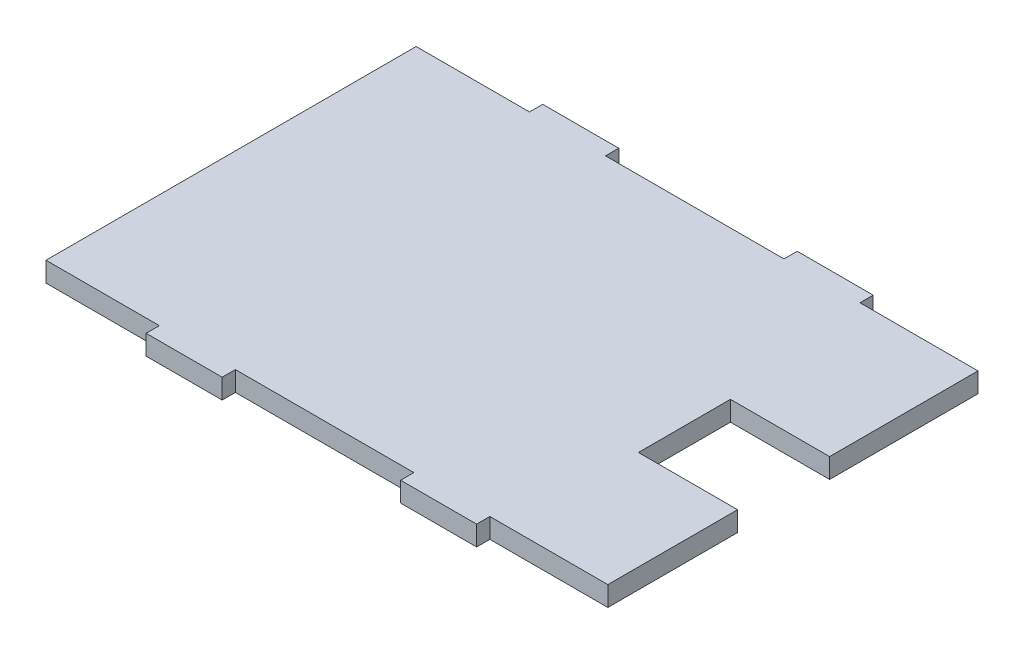
ISO-10303-21;
HEADER;
FILE_DESCRIPTION(('STEP AP214'),'2;1');
FILE_NAME('part.step','',(''),(''),'','','');
FILE_SCHEMA(('AUTOMOTIVE_DESIGN { 1 0 10303 214 1 1 1 1 }'));
ENDSEC;
DATA;
#1=APPLICATION_CONTEXT('core data for automotive mechanical design processes');
#2=APPLICATION_PROTOCOL_DEFINITION('international standard','automotive_design',2000,#1);
#3=PRODUCT_CONTEXT('',#1,'mechanical');
#4=PRODUCT('Part','Part','',(#3));
#5=PRODUCT_RELATED_PRODUCT_CATEGORY('part','',(#4));
#6=PRODUCT_DEFINITION_FORMATION('','',#4);
#7=PRODUCT_DEFINITION_CONTEXT('part definition',#1,'design');
#8=PRODUCT_DEFINITION('design','',#6,#7);
#9=PRODUCT_DEFINITION_SHAPE('','',#8);
#10=(LENGTH_UNIT() NAMED_UNIT(*) SI_UNIT(.MILLI.,.METRE.));
#11=(NAMED_UNIT(*) PLANE_ANGLE_UNIT() SI_UNIT($,.RADIAN.));
#12=(NAMED_UNIT(*) SI_UNIT($,.STERADIAN.) SOLID_ANGLE_UNIT());
#13=UNCERTAINTY_MEASURE_WITH_UNIT(LENGTH_MEASURE(1.E-05),#10,'distance_accuracy_value','');
#14=(GEOMETRIC_REPRESENTATION_CONTEXT(3) GLOBAL_UNCERTAINTY_ASSIGNED_CONTEXT((#13)) GLOBAL_UNIT_ASSIGNED_CONTEXT((#10,
#11,#12)) REPRESENTATION_CONTEXT('',''));
#15=CARTESIAN_POINT('',(0.,0.,0.));
#16=DIRECTION('',(0.,0.,1.));
#17=DIRECTION('',(1.,0.,0.));
#18=AXIS2_PLACEMENT_3D('',#15,#16,#17);
#19=CARTESIAN_POINT('',(27.94,3.048,0.));
#20=DIRECTION('',(-1.,0.,0.));
#21=DIRECTION('',(0.,0.,1.));
#22=AXIS2_PLACEMENT_3D('',#19,#20,#21);
#23=PLANE('',#22);
#24=DIRECTION('',(0.,0.,-1.));
#25=VECTOR('',#24,1.);
#26=CARTESIAN_POINT('',(27.94,0.,0.));
#27=LINE('',#26,#25);
#28=CARTESIAN_POINT('',(27.94,0.,8.50899999999999));
#29=VERTEX_POINT('',#28);
#30=CARTESIAN_POINT('',(27.94,0.,-5.63880000000001));
#31=VERTEX_POINT('',#30);
#32=EDGE_CURVE('E300',#29,#31,#27,.T.);
#33=ORIENTED_EDGE('',*,*,#32,.T.);
#34=DIRECTION('',(0.,-1.,0.));
#35=VECTOR('',#34,1.);
#36=CARTESIAN_POINT('',(27.94,3.048,-5.63880000000001));
#37=LINE('',#36,#35);
#38=CARTESIAN_POINT('',(27.94,3.048,-5.63880000000001));
#39=VERTEX_POINT('',#38);
#40=EDGE_CURVE('E11',#39,#31,#37,.T.);
#41=ORIENTED_EDGE('',*,*,#40,.F.);
#42=DIRECTION('',(0.,0.,-1.));
#43=VECTOR('',#42,1.);
#44=CARTESIAN_POINT('',(27.94,3.048,0.));
#45=LINE('',#44,#43);
#46=CARTESIAN_POINT('',(27.94,3.048,8.50899999999999));
#47=VERTEX_POINT('',#46);
#48=EDGE_CURVE('E233',#47,#39,#45,.T.);
#49=ORIENTED_EDGE('',*,*,#48,.F.);
#50=DIRECTION('',(0.,-1.,0.));
#51=VECTOR('',#50,1.);
#52=CARTESIAN_POINT('',(27.94,3.048,8.50899999999999));
#53=LINE('',#52,#51);
#54=EDGE_CURVE('E223',#47,#29,#53,.T.);
#55=ORIENTED_EDGE('',*,*,#54,.T.);
#56=EDGE_LOOP('',(#33,#41,#49,#55));
#57=FACE_BOUND('',#56,.T.);
#58=ADVANCED_FACE('F35',(#57),#23,.F.);
#59=CARTESIAN_POINT('',(0.,3.048,-5.63880000000001));
#60=DIRECTION('',(0.,0.,-1.));
#61=DIRECTION('',(-1.,0.,0.));
#62=AXIS2_PLACEMENT_3D('',#59,#60,#61);
#63=PLANE('',#62);
#64=DIRECTION('',(1.,0.,0.));
#65=VECTOR('',#64,1.);
#66=CARTESIAN_POINT('',(0.,0.,-5.63880000000001));
#67=LINE('',#66,#65);
#68=CARTESIAN_POINT('',(43.18,0.,-5.63880000000001));
#69=VERTEX_POINT('',#68);
#70=EDGE_CURVE('E295',#31,#69,#67,.T.);
#71=ORIENTED_EDGE('',*,*,#70,.T.);
#72=DIRECTION('',(0.,-1.,0.));
#73=VECTOR('',#72,1.);
#74=CARTESIAN_POINT('',(43.18,3.048,-5.63880000000001));
#75=LINE('',#74,#73);
#76=CARTESIAN_POINT('',(43.18,3.048,-5.63880000000001));
#77=VERTEX_POINT('',#76);
#78=EDGE_CURVE('E43',#77,#69,#75,.T.);
#79=ORIENTED_EDGE('',*,*,#78,.F.);
#80=DIRECTION('',(1.,0.,0.));
#81=VECTOR('',#80,1.);
#82=CARTESIAN_POINT('',(0.,3.048,-5.63880000000001));
#83=LINE('',#82,#81);
#84=EDGE_CURVE('E138',#39,#77,#83,.T.);
#85=ORIENTED_EDGE('',*,*,#84,.F.);
#86=ORIENTED_EDGE('',*,*,#40,.T.);
#87=EDGE_LOOP('',(#71,#79,#85,#86));
#88=FACE_BOUND('',#87,.T.);
#89=ADVANCED_FACE('F296',(#88),#63,.F.);
#90=CARTESIAN_POINT('',(43.18,3.048,0.));
#91=DIRECTION('',(1.,0.,0.));
#92=DIRECTION('',(0.,0.,-1.));
#93=AXIS2_PLACEMENT_3D('',#90,#91,#92);
#94=PLANE('',#93);
#95=DIRECTION('',(0.,0.,1.));
#96=VECTOR('',#95,1.);
#97=CARTESIAN_POINT('',(43.18,0.,0.));
#98=LINE('',#97,#96);
#99=CARTESIAN_POINT('',(43.18,0.,-28.448));
#100=VERTEX_POINT('',#99);
#101=EDGE_CURVE('E240',#100,#69,#98,.T.);
#102=ORIENTED_EDGE('',*,*,#101,.F.);
#103=DIRECTION('',(0.,-1.,0.));
#104=VECTOR('',#103,1.);
#105=CARTESIAN_POINT('',(43.18,3.048,-28.448));
#106=LINE('',#105,#104);
#107=CARTESIAN_POINT('',(43.18,3.048,-28.448));
#108=VERTEX_POINT('',#107);
#109=EDGE_CURVE('E289',#108,#100,#106,.T.);
#110=ORIENTED_EDGE('',*,*,#109,.F.);
#111=DIRECTION('',(0.,0.,1.));
#112=VECTOR('',#111,1.);
#113=CARTESIAN_POINT('',(43.18,3.048,0.));
#114=LINE('',#113,#112);
#115=EDGE_CURVE('E222',#108,#77,#114,.T.);
#116=ORIENTED_EDGE('',*,*,#115,.T.);
#117=ORIENTED_EDGE('',*,*,#78,.T.);
#118=EDGE_LOOP('',(#102,#110,#116,#117));
#119=FACE_BOUND('',#118,.T.);
#120=ADVANCED_FACE('F292',(#119),#94,.T.);
#121=CARTESIAN_POINT('',(0.,3.048,-28.448));
#122=DIRECTION('',(0.,0.,-1.));
#123=DIRECTION('',(-1.,0.,0.));
#124=AXIS2_PLACEMENT_3D('',#121,#122,#123);
#125=PLANE('',#124);
#126=DIRECTION('',(1.,0.,0.));
#127=VECTOR('',#126,1.);
#128=CARTESIAN_POINT('',(0.,0.,-28.448));
#129=LINE('',#128,#127);
#130=CARTESIAN_POINT('',(25.0444,0.,-28.448));
#131=VERTEX_POINT('',#130);
#132=EDGE_CURVE('E305',#131,#100,#129,.T.);
#133=ORIENTED_EDGE('',*,*,#132,.F.);
#134=DIRECTION('',(0.,-1.,0.));
#135=VECTOR('',#134,1.);
#136=CARTESIAN_POINT('',(25.0444,3.048,-28.448));
#137=LINE('',#136,#135);
#138=CARTESIAN_POINT('',(25.0444,3.048,-28.448));
#139=VERTEX_POINT('',#138);
#140=EDGE_CURVE('E287',#139,#131,#137,.T.);
#141=ORIENTED_EDGE('',*,*,#140,.F.);
#142=DIRECTION('',(1.,0.,0.));
#143=VECTOR('',#142,1.);
#144=CARTESIAN_POINT('',(0.,3.048,-28.448));
#145=LINE('',#144,#143);
#146=EDGE_CURVE('E228',#139,#108,#145,.T.);
#147=ORIENTED_EDGE('',*,*,#146,.T.);
#148=ORIENTED_EDGE('',*,*,#109,.T.);
#149=EDGE_LOOP('',(#133,#141,#147,#148));
#150=FACE_BOUND('',#149,.T.);
#151=ADVANCED_FACE('F480',(#150),#125,.T.);
#152=CARTESIAN_POINT('',(25.0444,3.048,0.));
#153=DIRECTION('',(1.,0.,0.));
#154=DIRECTION('',(0.,0.,-1.));
#155=AXIS2_PLACEMENT_3D('',#152,#153,#154);
#156=PLANE('',#155);
#157=DIRECTION('',(0.,0.,1.));
#158=VECTOR('',#157,1.);
#159=CARTESIAN_POINT('',(25.0444,0.,0.));
#160=LINE('',#159,#158);
#161=CARTESIAN_POINT('',(25.0444,0.,-30.48));
#162=VERTEX_POINT('',#161);
#163=EDGE_CURVE('E306',#162,#131,#160,.T.);
#164=ORIENTED_EDGE('',*,*,#163,.F.);
#165=DIRECTION('',(0.,-1.,0.));
#166=VECTOR('',#165,1.);
#167=CARTESIAN_POINT('',(25.0444,3.048,-30.48));
#168=LINE('',#167,#166);
#169=CARTESIAN_POINT('',(25.0444,3.048,-30.48));
#170=VERTEX_POINT('',#169);
#171=EDGE_CURVE('E285',#170,#162,#168,.T.);
#172=ORIENTED_EDGE('',*,*,#171,.F.);
#173=DIRECTION('',(0.,0.,1.));
#174=VECTOR('',#173,1.);
#175=CARTESIAN_POINT('',(25.0444,3.048,0.));
#176=LINE('',#175,#174);
#177=EDGE_CURVE('E232',#170,#139,#176,.T.);
#178=ORIENTED_EDGE('',*,*,#177,.T.);
#179=ORIENTED_EDGE('',*,*,#140,.T.);
#180=EDGE_LOOP('',(#164,#172,#178,#179));
#181=FACE_BOUND('',#180,.T.);
#182=ADVANCED_FACE('F397',(#181),#156,.T.);
#183=CARTESIAN_POINT('',(0.,3.048,-30.48));
#184=DIRECTION('',(0.,0.,-1.));
#185=DIRECTION('',(-1.,0.,0.));
#186=AXIS2_PLACEMENT_3D('',#183,#184,#185);
#187=PLANE('',#186);
#188=DIRECTION('',(1.,0.,0.));
#189=VECTOR('',#188,1.);
#190=CARTESIAN_POINT('',(0.,0.,-30.48));
#191=LINE('',#190,#189);
#192=CARTESIAN_POINT('',(13.3604,0.,-30.48));
#193=VERTEX_POINT('',#192);
#194=EDGE_CURVE('E311',#193,#162,#191,.T.);
#195=ORIENTED_EDGE('',*,*,#194,.F.);
#196=DIRECTION('',(0.,-1.,0.));
#197=VECTOR('',#196,1.);
#198=CARTESIAN_POINT('',(13.3604,3.048,-30.48));
#199=LINE('',#198,#197);
#200=CARTESIAN_POINT('',(13.3604,3.048,-30.48));
#201=VERTEX_POINT('',#200);
#202=EDGE_CURVE('E283',#201,#193,#199,.T.);
#203=ORIENTED_EDGE('',*,*,#202,.F.);
#204=DIRECTION('',(1.,0.,0.));
#205=VECTOR('',#204,1.);
#206=CARTESIAN_POINT('',(0.,3.048,-30.48));
#207=LINE('',#206,#205);
#208=EDGE_CURVE('E390',#201,#170,#207,.T.);
#209=ORIENTED_EDGE('',*,*,#208,.T.);
#210=ORIENTED_EDGE('',*,*,#171,.T.);
#211=EDGE_LOOP('',(#195,#203,#209,#210));
#212=FACE_BOUND('',#211,.T.);
#213=ADVANCED_FACE('F403',(#212),#187,.T.);
#214=CARTESIAN_POINT('',(13.3604,3.048,0.));
#215=DIRECTION('',(-1.,0.,0.));
#216=DIRECTION('',(0.,0.,1.));
#217=AXIS2_PLACEMENT_3D('',#214,#215,#216);
#218=PLANE('',#217);
#219=DIRECTION('',(0.,0.,-1.));
#220=VECTOR('',#219,1.);
#221=CARTESIAN_POINT('',(13.3604,0.,0.));
#222=LINE('',#221,#220);
#223=CARTESIAN_POINT('',(13.3604,0.,-28.448));
#224=VERTEX_POINT('',#223);
#225=EDGE_CURVE('E314',#224,#193,#222,.T.);
#226=ORIENTED_EDGE('',*,*,#225,.F.);
#227=DIRECTION('',(0.,-1.,0.));
#228=VECTOR('',#227,1.);
#229=CARTESIAN_POINT('',(13.3604,3.048,-28.448));
#230=LINE('',#229,#228);
#231=CARTESIAN_POINT('',(13.3604,3.048,-28.448));
#232=VERTEX_POINT('',#231);
#233=EDGE_CURVE('E281',#232,#224,#230,.T.);
#234=ORIENTED_EDGE('',*,*,#233,.F.);
#235=DIRECTION('',(0.,0.,-1.));
#236=VECTOR('',#235,1.);
#237=CARTESIAN_POINT('',(13.3604,3.048,0.));
#238=LINE('',#237,#236);
#239=EDGE_CURVE('E387',#232,#201,#238,.T.);
#240=ORIENTED_EDGE('',*,*,#239,.T.);
#241=ORIENTED_EDGE('',*,*,#202,.T.);
#242=EDGE_LOOP('',(#226,#234,#240,#241));
#243=FACE_BOUND('',#242,.T.);
#244=ADVANCED_FACE('F406',(#243),#218,.T.);
#245=CARTESIAN_POINT('',(0.,3.048,-28.448));
#246=DIRECTION('',(0.,0.,-1.));
#247=DIRECTION('',(-1.,0.,0.));
#248=AXIS2_PLACEMENT_3D('',#245,#246,#247);
#249=PLANE('',#248);
#250=DIRECTION('',(1.,0.,0.));
#251=VECTOR('',#250,1.);
#252=CARTESIAN_POINT('',(0.,0.,-28.448));
#253=LINE('',#252,#251);
#254=CARTESIAN_POINT('',(-14.0716,0.,-28.448));
#255=VERTEX_POINT('',#254);
#256=EDGE_CURVE('E317',#255,#224,#253,.T.);
#257=ORIENTED_EDGE('',*,*,#256,.F.);
#258=DIRECTION('',(0.,-1.,0.));
#259=VECTOR('',#258,1.);
#260=CARTESIAN_POINT('',(-14.0716,3.048,-28.448));
#261=LINE('',#260,#259);
#262=CARTESIAN_POINT('',(-14.0716,3.048,-28.448));
#263=VERTEX_POINT('',#262);
#264=EDGE_CURVE('E279',#263,#255,#261,.T.);
#265=ORIENTED_EDGE('',*,*,#264,.F.);
#266=DIRECTION('',(1.,0.,0.));
#267=VECTOR('',#266,1.);
#268=CARTESIAN_POINT('',(0.,3.048,-28.448));
#269=LINE('',#268,#267);
#270=EDGE_CURVE('E384',#263,#232,#269,.T.);
#271=ORIENTED_EDGE('',*,*,#270,.T.);
#272=ORIENTED_EDGE('',*,*,#233,.T.);
#273=EDGE_LOOP('',(#257,#265,#271,#272));
#274=FACE_BOUND('',#273,.T.);
#275=ADVANCED_FACE('F411',(#274),#249,.T.);
#276=CARTESIAN_POINT('',(-14.0716,3.048,0.));
#277=DIRECTION('',(1.,0.,0.));
#278=DIRECTION('',(0.,0.,-1.));
#279=AXIS2_PLACEMENT_3D('',#276,#277,#278);
#280=PLANE('',#279);
#281=DIRECTION('',(0.,0.,1.));
#282=VECTOR('',#281,1.);
#283=CARTESIAN_POINT('',(-14.0716,0.,0.));
#284=LINE('',#283,#282);
#285=CARTESIAN_POINT('',(-14.0716,0.,-30.48));
#286=VERTEX_POINT('',#285);
#287=EDGE_CURVE('E320',#286,#255,#284,.T.);
#288=ORIENTED_EDGE('',*,*,#287,.F.);
#289=DIRECTION('',(0.,-1.,0.));
#290=VECTOR('',#289,1.);
#291=CARTESIAN_POINT('',(-14.0716,3.048,-30.48));
#292=LINE('',#291,#290);
#293=CARTESIAN_POINT('',(-14.0716,3.048,-30.48));
#294=VERTEX_POINT('',#293);
#295=EDGE_CURVE('E277',#294,#286,#292,.T.);
#296=ORIENTED_EDGE('',*,*,#295,.F.);
#297=DIRECTION('',(0.,0.,1.));
#298=VECTOR('',#297,1.);
#299=CARTESIAN_POINT('',(-14.0716,3.048,0.));
#300=LINE('',#299,#298);
#301=EDGE_CURVE('E381',#294,#263,#300,.T.);
#302=ORIENTED_EDGE('',*,*,#301,.T.);
#303=ORIENTED_EDGE('',*,*,#264,.T.);
#304=EDGE_LOOP('',(#288,#296,#302,#303));
#305=FACE_BOUND('',#304,.T.);
#306=ADVANCED_FACE('F414',(#305),#280,.T.);
#307=CARTESIAN_POINT('',(0.,3.048,-30.48));
#308=DIRECTION('',(0.,0.,-1.));
#309=DIRECTION('',(-1.,0.,0.));
#310=AXIS2_PLACEMENT_3D('',#307,#308,#309);
#311=PLANE('',#310);
#312=DIRECTION('',(1.,0.,0.));
#313=VECTOR('',#312,1.);
#314=CARTESIAN_POINT('',(0.,0.,-30.48));
#315=LINE('',#314,#313);
#316=CARTESIAN_POINT('',(-25.7556,0.,-30.48));
#317=VERTEX_POINT('',#316);
#318=EDGE_CURVE('E323',#317,#286,#315,.T.);
#319=ORIENTED_EDGE('',*,*,#318,.F.);
#320=DIRECTION('',(0.,-1.,0.));
#321=VECTOR('',#320,1.);
#322=CARTESIAN_POINT('',(-25.7556,3.048,-30.48));
#323=LINE('',#322,#321);
#324=CARTESIAN_POINT('',(-25.7556,3.048,-30.48));
#325=VERTEX_POINT('',#324);
#326=EDGE_CURVE('E275',#325,#317,#323,.T.);
#327=ORIENTED_EDGE('',*,*,#326,.F.);
#328=DIRECTION('',(1.,0.,0.));
#329=VECTOR('',#328,1.);
#330=CARTESIAN_POINT('',(0.,3.048,-30.48));
#331=LINE('',#330,#329);
#332=EDGE_CURVE('E378',#325,#294,#331,.T.);
#333=ORIENTED_EDGE('',*,*,#332,.T.);
#334=ORIENTED_EDGE('',*,*,#295,.T.);
#335=EDGE_LOOP('',(#319,#327,#333,#334));
#336=FACE_BOUND('',#335,.T.);
#337=ADVANCED_FACE('F419',(#336),#311,.T.);
#338=CARTESIAN_POINT('',(-25.7556,3.048,0.));
#339=DIRECTION('',(-1.,0.,0.));
#340=DIRECTION('',(0.,0.,1.));
#341=AXIS2_PLACEMENT_3D('',#338,#339,#340);
#342=PLANE('',#341);
#343=DIRECTION('',(0.,0.,-1.));
#344=VECTOR('',#343,1.);
#345=CARTESIAN_POINT('',(-25.7556,0.,0.));
#346=LINE('',#345,#344);
#347=CARTESIAN_POINT('',(-25.7556,0.,-28.448));
#348=VERTEX_POINT('',#347);
#349=EDGE_CURVE('E326',#348,#317,#346,.T.);
#350=ORIENTED_EDGE('',*,*,#349,.F.);
#351=DIRECTION('',(0.,-1.,0.));
#352=VECTOR('',#351,1.);
#353=CARTESIAN_POINT('',(-25.7556,3.048,-28.448));
#354=LINE('',#353,#352);
#355=CARTESIAN_POINT('',(-25.7556,3.048,-28.448));
#356=VERTEX_POINT('',#355);
#357=EDGE_CURVE('E273',#356,#348,#354,.T.);
#358=ORIENTED_EDGE('',*,*,#357,.F.);
#359=DIRECTION('',(0.,0.,-1.));
#360=VECTOR('',#359,1.);
#361=CARTESIAN_POINT('',(-25.7556,3.048,0.));
#362=LINE('',#361,#360);
#363=EDGE_CURVE('E375',#356,#325,#362,.T.);
#364=ORIENTED_EDGE('',*,*,#363,.T.);
#365=ORIENTED_EDGE('',*,*,#326,.T.);
#366=EDGE_LOOP('',(#350,#358,#364,#365));
#367=FACE_BOUND('',#366,.T.);
#368=ADVANCED_FACE('F422',(#367),#342,.T.);
#369=CARTESIAN_POINT('',(0.,3.048,-28.448));
#370=DIRECTION('',(0.,0.,-1.));
#371=DIRECTION('',(-1.,0.,0.));
#372=AXIS2_PLACEMENT_3D('',#369,#370,#371);
#373=PLANE('',#372);
#374=DIRECTION('',(1.,0.,0.));
#375=VECTOR('',#374,1.);
#376=CARTESIAN_POINT('',(0.,0.,-28.448));
#377=LINE('',#376,#375);
#378=CARTESIAN_POINT('',(-43.18,0.,-28.448));
#379=VERTEX_POINT('',#378);
#380=EDGE_CURVE('E329',#379,#348,#377,.T.);
#381=ORIENTED_EDGE('',*,*,#380,.F.);
#382=DIRECTION('',(0.,-1.,0.));
#383=VECTOR('',#382,1.);
#384=CARTESIAN_POINT('',(-43.18,3.048,-28.448));
#385=LINE('',#384,#383);
#386=CARTESIAN_POINT('',(-43.18,3.048,-28.448));
#387=VERTEX_POINT('',#386);
#388=EDGE_CURVE('E271',#387,#379,#385,.T.);
#389=ORIENTED_EDGE('',*,*,#388,.F.);
#390=DIRECTION('',(1.,0.,0.));
#391=VECTOR('',#390,1.);
#392=CARTESIAN_POINT('',(0.,3.048,-28.448));
#393=LINE('',#392,#391);
#394=EDGE_CURVE('E372',#387,#356,#393,.T.);
#395=ORIENTED_EDGE('',*,*,#394,.T.);
#396=ORIENTED_EDGE('',*,*,#357,.T.);
#397=EDGE_LOOP('',(#381,#389,#395,#396));
#398=FACE_BOUND('',#397,.T.);
#399=ADVANCED_FACE('F426',(#398),#373,.T.);
#400=CARTESIAN_POINT('',(-43.18,3.048,0.));
#401=DIRECTION('',(1.,0.,0.));
#402=DIRECTION('',(0.,0.,-1.));
#403=AXIS2_PLACEMENT_3D('',#400,#401,#402);
#404=PLANE('',#403);
#405=DIRECTION('',(0.,0.,1.));
#406=VECTOR('',#405,1.);
#407=CARTESIAN_POINT('',(-43.18,0.,0.));
#408=LINE('',#407,#406);
#409=CARTESIAN_POINT('',(-43.18,0.,28.448));
#410=VERTEX_POINT('',#409);
#411=EDGE_CURVE('E332',#379,#410,#408,.T.);
#412=ORIENTED_EDGE('',*,*,#411,.T.);
#413=DIRECTION('',(0.,-1.,0.));
#414=VECTOR('',#413,1.);
#415=CARTESIAN_POINT('',(-43.18,3.048,28.448));
#416=LINE('',#415,#414);
#417=CARTESIAN_POINT('',(-43.18,3.048,28.448));
#418=VERTEX_POINT('',#417);
#419=EDGE_CURVE('E268',#418,#410,#416,.T.);
#420=ORIENTED_EDGE('',*,*,#419,.F.);
#421=DIRECTION('',(0.,0.,1.));
#422=VECTOR('',#421,1.);
#423=CARTESIAN_POINT('',(-43.18,3.048,0.));
#424=LINE('',#423,#422);
#425=EDGE_CURVE('E370',#387,#418,#424,.T.);
#426=ORIENTED_EDGE('',*,*,#425,.F.);
#427=ORIENTED_EDGE('',*,*,#388,.T.);
#428=EDGE_LOOP('',(#412,#420,#426,#427));
#429=FACE_BOUND('',#428,.T.);
#430=ADVANCED_FACE('F431',(#429),#404,.F.);
#431=CARTESIAN_POINT('',(0.,3.048,28.448));
#432=DIRECTION('',(0.,0.,-1.));
#433=DIRECTION('',(-1.,0.,0.));
#434=AXIS2_PLACEMENT_3D('',#431,#432,#433);
#435=PLANE('',#434);
#436=DIRECTION('',(1.,0.,0.));
#437=VECTOR('',#436,1.);
#438=CARTESIAN_POINT('',(0.,0.,28.448));
#439=LINE('',#438,#437);
#440=CARTESIAN_POINT('',(-25.7556,0.,28.448));
#441=VERTEX_POINT('',#440);
#442=EDGE_CURVE('E334',#410,#441,#439,.T.);
#443=ORIENTED_EDGE('',*,*,#442,.T.);
#444=DIRECTION('',(0.,-1.,0.));
#445=VECTOR('',#444,1.);
#446=CARTESIAN_POINT('',(-25.7556,3.048,28.448));
#447=LINE('',#446,#445);
#448=CARTESIAN_POINT('',(-25.7556,3.048,28.448));
#449=VERTEX_POINT('',#448);
#450=EDGE_CURVE('E265',#449,#441,#447,.T.);
#451=ORIENTED_EDGE('',*,*,#450,.F.);
#452=DIRECTION('',(1.,0.,0.));
#453=VECTOR('',#452,1.);
#454=CARTESIAN_POINT('',(0.,3.048,28.448));
#455=LINE('',#454,#453);
#456=EDGE_CURVE('E368',#418,#449,#455,.T.);
#457=ORIENTED_EDGE('',*,*,#456,.F.);
#458=ORIENTED_EDGE('',*,*,#419,.T.);
#459=EDGE_LOOP('',(#443,#451,#457,#458));
#460=FACE_BOUND('',#459,.T.);
#461=ADVANCED_FACE('F437',(#460),#435,.F.);
#462=CARTESIAN_POINT('',(-25.7556,3.048,0.));
#463=DIRECTION('',(1.,0.,0.));
#464=DIRECTION('',(0.,0.,-1.));
#465=AXIS2_PLACEMENT_3D('',#462,#463,#464);
#466=PLANE('',#465);
#467=DIRECTION('',(0.,0.,1.));
#468=VECTOR('',#467,1.);
#469=CARTESIAN_POINT('',(-25.7556,0.,0.));
#470=LINE('',#469,#468);
#471=CARTESIAN_POINT('',(-25.7556,0.,30.48));
#472=VERTEX_POINT('',#471);
#473=EDGE_CURVE('E336',#441,#472,#470,.T.);
#474=ORIENTED_EDGE('',*,*,#473,.T.);
#475=DIRECTION('',(0.,-1.,0.));
#476=VECTOR('',#475,1.);
#477=CARTESIAN_POINT('',(-25.7556,3.048,30.48));
#478=LINE('',#477,#476);
#479=CARTESIAN_POINT('',(-25.7556,3.048,30.48));
#480=VERTEX_POINT('',#479);
#481=EDGE_CURVE('E262',#480,#472,#478,.T.);
#482=ORIENTED_EDGE('',*,*,#481,.F.);
#483=DIRECTION('',(0.,0.,1.));
#484=VECTOR('',#483,1.);
#485=CARTESIAN_POINT('',(-25.7556,3.048,0.));
#486=LINE('',#485,#484);
#487=EDGE_CURVE('E366',#449,#480,#486,.T.);
#488=ORIENTED_EDGE('',*,*,#487,.F.);
#489=ORIENTED_EDGE('',*,*,#450,.T.);
#490=EDGE_LOOP('',(#474,#482,#488,#489));
#491=FACE_BOUND('',#490,.T.);
#492=ADVANCED_FACE('F441',(#491),#466,.F.);
#493=CARTESIAN_POINT('',(0.,3.048,30.48));
#494=DIRECTION('',(0.,0.,-1.));
#495=DIRECTION('',(-1.,0.,0.));
#496=AXIS2_PLACEMENT_3D('',#493,#494,#495);
#497=PLANE('',#496);
#498=DIRECTION('',(1.,0.,0.));
#499=VECTOR('',#498,1.);
#500=CARTESIAN_POINT('',(0.,0.,30.48));
#501=LINE('',#500,#499);
#502=CARTESIAN_POINT('',(-14.0716,0.,30.48));
#503=VERTEX_POINT('',#502);
#504=EDGE_CURVE('E338',#472,#503,#501,.T.);
#505=ORIENTED_EDGE('',*,*,#504,.T.);
#506=DIRECTION('',(0.,-1.,0.));
#507=VECTOR('',#506,1.);
#508=CARTESIAN_POINT('',(-14.0716,3.048,30.48));
#509=LINE('',#508,#507);
#510=CARTESIAN_POINT('',(-14.0716,3.048,30.48));
#511=VERTEX_POINT('',#510);
#512=EDGE_CURVE('E259',#511,#503,#509,.T.);
#513=ORIENTED_EDGE('',*,*,#512,.F.);
#514=DIRECTION('',(1.,0.,0.));
#515=VECTOR('',#514,1.);
#516=CARTESIAN_POINT('',(0.,3.048,30.48));
#517=LINE('',#516,#515);
#518=EDGE_CURVE('E364',#480,#511,#517,.T.);
#519=ORIENTED_EDGE('',*,*,#518,.F.);
#520=ORIENTED_EDGE('',*,*,#481,.T.);
#521=EDGE_LOOP('',(#505,#513,#519,#520));
#522=FACE_BOUND('',#521,.T.);
#523=ADVANCED_FACE('F446',(#522),#497,.F.);
#524=CARTESIAN_POINT('',(-14.0716,3.048,0.));
#525=DIRECTION('',(-1.,0.,0.));
#526=DIRECTION('',(0.,0.,1.));
#527=AXIS2_PLACEMENT_3D('',#524,#525,#526);
#528=PLANE('',#527);
#529=DIRECTION('',(0.,0.,-1.));
#530=VECTOR('',#529,1.);
#531=CARTESIAN_POINT('',(-14.0716,0.,0.));
#532=LINE('',#531,#530);
#533=CARTESIAN_POINT('',(-14.0716,0.,28.448));
#534=VERTEX_POINT('',#533);
#535=EDGE_CURVE('E340',#503,#534,#532,.T.);
#536=ORIENTED_EDGE('',*,*,#535,.T.);
#537=DIRECTION('',(0.,-1.,0.));
#538=VECTOR('',#537,1.);
#539=CARTESIAN_POINT('',(-14.0716,3.048,28.448));
#540=LINE('',#539,#538);
#541=CARTESIAN_POINT('',(-14.0716,3.048,28.448));
#542=VERTEX_POINT('',#541);
#543=EDGE_CURVE('E256',#542,#534,#540,.T.);
#544=ORIENTED_EDGE('',*,*,#543,.F.);
#545=DIRECTION('',(0.,0.,-1.));
#546=VECTOR('',#545,1.);
#547=CARTESIAN_POINT('',(-14.0716,3.048,0.));
#548=LINE('',#547,#546);
#549=EDGE_CURVE('E362',#511,#542,#548,.T.);
#550=ORIENTED_EDGE('',*,*,#549,.F.);
#551=ORIENTED_EDGE('',*,*,#512,.T.);
#552=EDGE_LOOP('',(#536,#544,#550,#551));
#553=FACE_BOUND('',#552,.T.);
#554=ADVANCED_FACE('F452',(#553),#528,.F.);
#555=CARTESIAN_POINT('',(0.,3.048,28.448));
#556=DIRECTION('',(0.,0.,-1.));
#557=DIRECTION('',(-1.,0.,0.));
#558=AXIS2_PLACEMENT_3D('',#555,#556,#557);
#559=PLANE('',#558);
#560=DIRECTION('',(1.,0.,0.));
#561=VECTOR('',#560,1.);
#562=CARTESIAN_POINT('',(0.,0.,28.448));
#563=LINE('',#562,#561);
#564=CARTESIAN_POINT('',(13.3604,0.,28.448));
#565=VERTEX_POINT('',#564);
#566=EDGE_CURVE('E342',#534,#565,#563,.T.);
#567=ORIENTED_EDGE('',*,*,#566,.T.);
#568=DIRECTION('',(0.,-1.,0.));
#569=VECTOR('',#568,1.);
#570=CARTESIAN_POINT('',(13.3604,3.048,28.448));
#571=LINE('',#570,#569);
#572=CARTESIAN_POINT('',(13.3604,3.048,28.448));
#573=VERTEX_POINT('',#572);
#574=EDGE_CURVE('E253',#573,#565,#571,.T.);
#575=ORIENTED_EDGE('',*,*,#574,.F.);
#576=DIRECTION('',(1.,0.,0.));
#577=VECTOR('',#576,1.);
#578=CARTESIAN_POINT('',(0.,3.048,28.448));
#579=LINE('',#578,#577);
#580=EDGE_CURVE('E360',#542,#573,#579,.T.);
#581=ORIENTED_EDGE('',*,*,#580,.F.);
#582=ORIENTED_EDGE('',*,*,#543,.T.);
#583=EDGE_LOOP('',(#567,#575,#581,#582));
#584=FACE_BOUND('',#583,.T.);
#585=ADVANCED_FACE('F456',(#584),#559,.F.);
#586=CARTESIAN_POINT('',(13.3604,3.048,0.));
#587=DIRECTION('',(1.,0.,0.));
#588=DIRECTION('',(0.,0.,-1.));
#589=AXIS2_PLACEMENT_3D('',#586,#587,#588);
#590=PLANE('',#589);
#591=DIRECTION('',(0.,0.,1.));
#592=VECTOR('',#591,1.);
#593=CARTESIAN_POINT('',(13.3604,0.,0.));
#594=LINE('',#593,#592);
#595=CARTESIAN_POINT('',(13.3604,0.,30.48));
#596=VERTEX_POINT('',#595);
#597=EDGE_CURVE('E344',#565,#596,#594,.T.);
#598=ORIENTED_EDGE('',*,*,#597,.T.);
#599=DIRECTION('',(0.,-1.,0.));
#600=VECTOR('',#599,1.);
#601=CARTESIAN_POINT('',(13.3604,3.048,30.48));
#602=LINE('',#601,#600);
#603=CARTESIAN_POINT('',(13.3604,3.048,30.48));
#604=VERTEX_POINT('',#603);
#605=EDGE_CURVE('E250',#604,#596,#602,.T.);
#606=ORIENTED_EDGE('',*,*,#605,.F.);
#607=DIRECTION('',(0.,0.,1.));
#608=VECTOR('',#607,1.);
#609=CARTESIAN_POINT('',(13.3604,3.048,0.));
#610=LINE('',#609,#608);
#611=EDGE_CURVE('E358',#573,#604,#610,.T.);
#612=ORIENTED_EDGE('',*,*,#611,.F.);
#613=ORIENTED_EDGE('',*,*,#574,.T.);
#614=EDGE_LOOP('',(#598,#606,#612,#613));
#615=FACE_BOUND('',#614,.T.);
#616=ADVANCED_FACE('F461',(#615),#590,.F.);
#617=CARTESIAN_POINT('',(0.,3.048,30.48));
#618=DIRECTION('',(0.,0.,-1.));
#619=DIRECTION('',(-1.,0.,0.));
#620=AXIS2_PLACEMENT_3D('',#617,#618,#619);
#621=PLANE('',#620);
#622=DIRECTION('',(1.,0.,0.));
#623=VECTOR('',#622,1.);
#624=CARTESIAN_POINT('',(0.,0.,30.48));
#625=LINE('',#624,#623);
#626=CARTESIAN_POINT('',(25.0444,0.,30.48));
#627=VERTEX_POINT('',#626);
#628=EDGE_CURVE('E346',#596,#627,#625,.T.);
#629=ORIENTED_EDGE('',*,*,#628,.T.);
#630=DIRECTION('',(0.,-1.,0.));
#631=VECTOR('',#630,1.);
#632=CARTESIAN_POINT('',(25.0444,3.048,30.48));
#633=LINE('',#632,#631);
#634=CARTESIAN_POINT('',(25.0444,3.048,30.48));
#635=VERTEX_POINT('',#634);
#636=EDGE_CURVE('E247',#635,#627,#633,.T.);
#637=ORIENTED_EDGE('',*,*,#636,.F.);
#638=DIRECTION('',(1.,0.,0.));
#639=VECTOR('',#638,1.);
#640=CARTESIAN_POINT('',(0.,3.048,30.48));
#641=LINE('',#640,#639);
#642=EDGE_CURVE('E356',#604,#635,#641,.T.);
#643=ORIENTED_EDGE('',*,*,#642,.F.);
#644=ORIENTED_EDGE('',*,*,#605,.T.);
#645=EDGE_LOOP('',(#629,#637,#643,#644));
#646=FACE_BOUND('',#645,.T.);
#647=ADVANCED_FACE('F464',(#646),#621,.F.);
#648=CARTESIAN_POINT('',(25.0444,3.048,0.));
#649=DIRECTION('',(-1.,0.,0.));
#650=DIRECTION('',(0.,0.,1.));
#651=AXIS2_PLACEMENT_3D('',#648,#649,#650);
#652=PLANE('',#651);
#653=DIRECTION('',(0.,0.,-1.));
#654=VECTOR('',#653,1.);
#655=CARTESIAN_POINT('',(25.0444,0.,0.));
#656=LINE('',#655,#654);
#657=CARTESIAN_POINT('',(25.0444,0.,28.448));
#658=VERTEX_POINT('',#657);
#659=EDGE_CURVE('E347',#627,#658,#656,.T.);
#660=ORIENTED_EDGE('',*,*,#659,.T.);
#661=DIRECTION('',(0.,-1.,0.));
#662=VECTOR('',#661,1.);
#663=CARTESIAN_POINT('',(25.0444,3.048,28.448));
#664=LINE('',#663,#662);
#665=CARTESIAN_POINT('',(25.0444,3.048,28.448));
#666=VERTEX_POINT('',#665);
#667=EDGE_CURVE('E218',#666,#658,#664,.T.);
#668=ORIENTED_EDGE('',*,*,#667,.F.);
#669=DIRECTION('',(0.,0.,-1.));
#670=VECTOR('',#669,1.);
#671=CARTESIAN_POINT('',(25.0444,3.048,0.));
#672=LINE('',#671,#670);
#673=EDGE_CURVE('E205',#635,#666,#672,.T.);
#674=ORIENTED_EDGE('',*,*,#673,.F.);
#675=ORIENTED_EDGE('',*,*,#636,.T.);
#676=EDGE_LOOP('',(#660,#668,#674,#675));
#677=FACE_BOUND('',#676,.T.);
#678=ADVANCED_FACE('F350',(#677),#652,.F.);
#679=CARTESIAN_POINT('',(0.,3.048,28.448));
#680=DIRECTION('',(0.,0.,-1.));
#681=DIRECTION('',(-1.,0.,0.));
#682=AXIS2_PLACEMENT_3D('',#679,#680,#681);
#683=PLANE('',#682);
#684=DIRECTION('',(1.,0.,0.));
#685=VECTOR('',#684,1.);
#686=CARTESIAN_POINT('',(0.,0.,28.448));
#687=LINE('',#686,#685);
#688=CARTESIAN_POINT('',(43.18,0.,28.448));
#689=VERTEX_POINT('',#688);
#690=EDGE_CURVE('E214',#658,#689,#687,.T.);
#691=ORIENTED_EDGE('',*,*,#690,.T.);
#692=DIRECTION('',(0.,-1.,0.));
#693=VECTOR('',#692,1.);
#694=CARTESIAN_POINT('',(43.18,3.048,28.448));
#695=LINE('',#694,#693);
#696=CARTESIAN_POINT('',(43.18,3.048,28.448));
#697=VERTEX_POINT('',#696);
#698=EDGE_CURVE('E211',#697,#689,#695,.T.);
#699=ORIENTED_EDGE('',*,*,#698,.F.);
#700=DIRECTION('',(1.,0.,0.));
#701=VECTOR('',#700,1.);
#702=CARTESIAN_POINT('',(0.,3.048,28.448));
#703=LINE('',#702,#701);
#704=EDGE_CURVE('E199',#666,#697,#703,.T.);
#705=ORIENTED_EDGE('',*,*,#704,.F.);
#706=ORIENTED_EDGE('',*,*,#667,.T.);
#707=EDGE_LOOP('',(#691,#699,#705,#706));
#708=FACE_BOUND('',#707,.T.);
#709=ADVANCED_FACE('F212',(#708),#683,.F.);
#710=CARTESIAN_POINT('',(43.18,0.,8.50899999999999));
#711=VERTEX_POINT('',#710);
#712=EDGE_CURVE('E237',#711,#689,#98,.T.);
#713=ORIENTED_EDGE('',*,*,#712,.F.);
#714=DIRECTION('',(0.,-1.,0.));
#715=VECTOR('',#714,1.);
#716=CARTESIAN_POINT('',(43.18,3.048,8.50899999999999));
#717=LINE('',#716,#715);
#718=CARTESIAN_POINT('',(43.18,3.048,8.50899999999999));
#719=VERTEX_POINT('',#718);
#720=EDGE_CURVE('E127',#719,#711,#717,.T.);
#721=ORIENTED_EDGE('',*,*,#720,.F.);
#722=EDGE_CURVE('E203',#719,#697,#114,.T.);
#723=ORIENTED_EDGE('',*,*,#722,.T.);
#724=ORIENTED_EDGE('',*,*,#698,.T.);
#725=EDGE_LOOP('',(#713,#721,#723,#724));
#726=FACE_BOUND('',#725,.T.);
#727=ADVANCED_FACE('F220',(#726),#94,.T.);
#728=CARTESIAN_POINT('',(0.,3.048,8.509));
#729=DIRECTION('',(0.,0.,1.));
#730=DIRECTION('',(1.,0.,0.));
#731=AXIS2_PLACEMENT_3D('',#728,#729,#730);
#732=PLANE('',#731);
#733=DIRECTION('',(-1.,0.,0.));
#734=VECTOR('',#733,1.);
#735=CARTESIAN_POINT('',(0.,0.,8.509));
#736=LINE('',#735,#734);
#737=EDGE_CURVE('E130',#711,#29,#736,.T.);
#738=ORIENTED_EDGE('',*,*,#737,.T.);
#739=ORIENTED_EDGE('',*,*,#54,.F.);
#740=DIRECTION('',(-1.,0.,0.));
#741=VECTOR('',#740,1.);
#742=CARTESIAN_POINT('',(0.,3.048,8.509));
#743=LINE('',#742,#741);
#744=EDGE_CURVE('E51',#719,#47,#743,.T.);
#745=ORIENTED_EDGE('',*,*,#744,.F.);
#746=ORIENTED_EDGE('',*,*,#720,.T.);
#747=EDGE_LOOP('',(#738,#739,#745,#746));
#748=FACE_BOUND('',#747,.T.);
#749=ADVANCED_FACE('F549',(#748),#732,.F.);
#750=CARTESIAN_POINT('',(0.,3.048,0.));
#751=DIRECTION('',(0.,1.,0.));
#752=DIRECTION('',(0.,0.,1.));
#753=AXIS2_PLACEMENT_3D('',#750,#751,#752);
#754=PLANE('',#753);
#755=ORIENTED_EDGE('',*,*,#48,.T.);
#756=ORIENTED_EDGE('',*,*,#84,.T.);
#757=ORIENTED_EDGE('',*,*,#115,.F.);
#758=ORIENTED_EDGE('',*,*,#146,.F.);
#759=ORIENTED_EDGE('',*,*,#177,.F.);
#760=ORIENTED_EDGE('',*,*,#208,.F.);
#761=ORIENTED_EDGE('',*,*,#239,.F.);
#762=ORIENTED_EDGE('',*,*,#270,.F.);
#763=ORIENTED_EDGE('',*,*,#301,.F.);
#764=ORIENTED_EDGE('',*,*,#332,.F.);
#765=ORIENTED_EDGE('',*,*,#363,.F.);
#766=ORIENTED_EDGE('',*,*,#394,.F.);
#767=ORIENTED_EDGE('',*,*,#425,.T.);
#768=ORIENTED_EDGE('',*,*,#456,.T.);
#769=ORIENTED_EDGE('',*,*,#487,.T.);
#770=ORIENTED_EDGE('',*,*,#518,.T.);
#771=ORIENTED_EDGE('',*,*,#549,.T.);
#772=ORIENTED_EDGE('',*,*,#580,.T.);
#773=ORIENTED_EDGE('',*,*,#611,.T.);
#774=ORIENTED_EDGE('',*,*,#642,.T.);
#775=ORIENTED_EDGE('',*,*,#673,.T.);
#776=ORIENTED_EDGE('',*,*,#704,.T.);
#777=ORIENTED_EDGE('',*,*,#722,.F.);
#778=ORIENTED_EDGE('',*,*,#744,.T.);
#779=EDGE_LOOP('',(#755,#756,#757,#758,#759,#760,#761,#762,#763,#764,#765,#766,#767,#768,#769,
#770,#771,#772,#773,#774,#775,#776,#777,#778));
#780=FACE_BOUND('',#779,.T.);
#781=ADVANCED_FACE('F201',(#780),#754,.T.);
#782=CARTESIAN_POINT('',(0.,0.,0.));
#783=DIRECTION('',(0.,1.,0.));
#784=DIRECTION('',(0.,0.,1.));
#785=AXIS2_PLACEMENT_3D('',#782,#783,#784);
#786=PLANE('',#785);
#787=ORIENTED_EDGE('',*,*,#32,.F.);
#788=ORIENTED_EDGE('',*,*,#737,.F.);
#789=ORIENTED_EDGE('',*,*,#712,.T.);
#790=ORIENTED_EDGE('',*,*,#690,.F.);
#791=ORIENTED_EDGE('',*,*,#659,.F.);
#792=ORIENTED_EDGE('',*,*,#628,.F.);
#793=ORIENTED_EDGE('',*,*,#597,.F.);
#794=ORIENTED_EDGE('',*,*,#566,.F.);
#795=ORIENTED_EDGE('',*,*,#535,.F.);
#796=ORIENTED_EDGE('',*,*,#504,.F.);
#797=ORIENTED_EDGE('',*,*,#473,.F.);
#798=ORIENTED_EDGE('',*,*,#442,.F.);
#799=ORIENTED_EDGE('',*,*,#411,.F.);
#800=ORIENTED_EDGE('',*,*,#380,.T.);
#801=ORIENTED_EDGE('',*,*,#349,.T.);
#802=ORIENTED_EDGE('',*,*,#318,.T.);
#803=ORIENTED_EDGE('',*,*,#287,.T.);
#804=ORIENTED_EDGE('',*,*,#256,.T.);
#805=ORIENTED_EDGE('',*,*,#225,.T.);
#806=ORIENTED_EDGE('',*,*,#194,.T.);
#807=ORIENTED_EDGE('',*,*,#163,.T.);
#808=ORIENTED_EDGE('',*,*,#132,.T.);
#809=ORIENTED_EDGE('',*,*,#101,.T.);
#810=ORIENTED_EDGE('',*,*,#70,.F.);
#811=EDGE_LOOP('',(#787,#788,#789,#790,#791,#792,#793,#794,#795,#796,#797,#798,#799,#800,#801,
#802,#803,#804,#805,#806,#807,#808,#809,#810));
#812=FACE_BOUND('',#811,.T.);
#813=ADVANCED_FACE('F302',(#812),#786,.F.);
#814=CLOSED_SHELL('',(#58,#89,#120,#151,#182,#213,#244,#275,#306,#337,#368,#399,#430,#461,#492,
#523,#554,#585,#616,#647,#678,#709,#727,#749,#781,#813));
#815=MANIFOLD_SOLID_BREP('B2',#814);
#816=ADVANCED_BREP_SHAPE_REPRESENTATION('',(#18,#815),#14);
#817=SHAPE_DEFINITION_REPRESENTATION(#9,#816);
ENDSEC;
END-ISO-10303-21;
